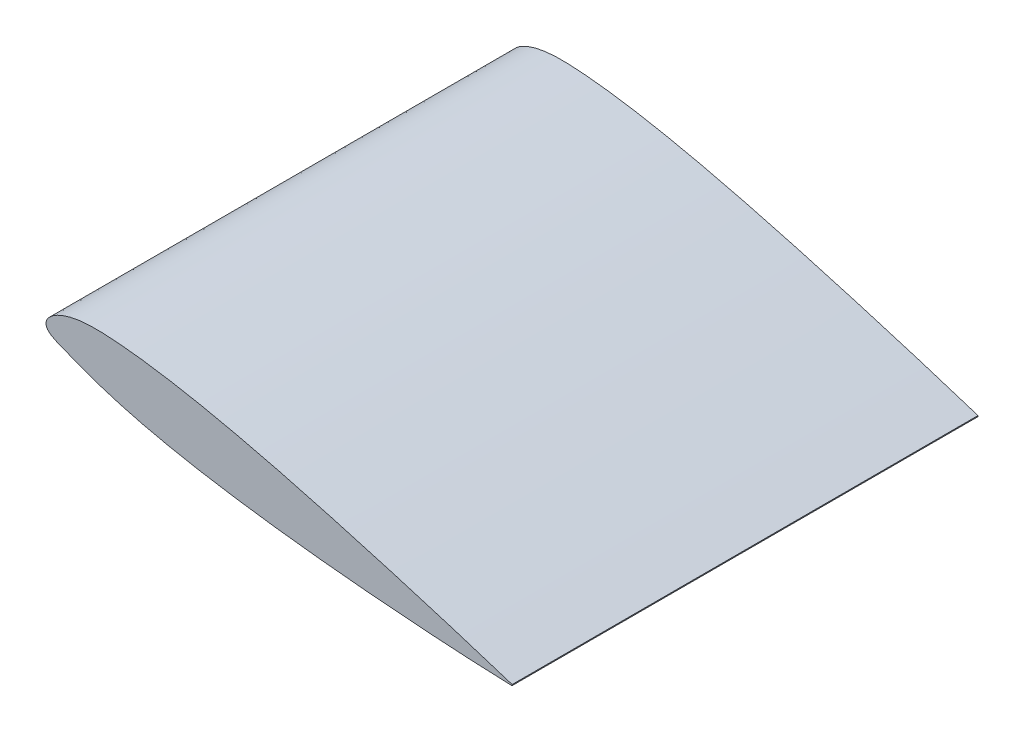
ISO-10303-21;
HEADER;
FILE_DESCRIPTION(('STEP AP214'),'2;1');
FILE_NAME('part.step','',(''),(''),'','','');
FILE_SCHEMA(('AUTOMOTIVE_DESIGN { 1 0 10303 214 1 1 1 1 }'));
ENDSEC;
DATA;
#1=APPLICATION_CONTEXT('core data for automotive mechanical design processes');
#2=APPLICATION_PROTOCOL_DEFINITION('international standard','automotive_design',2000,#1);
#3=PRODUCT_CONTEXT('',#1,'mechanical');
#4=PRODUCT('Part','Part','',(#3));
#5=PRODUCT_RELATED_PRODUCT_CATEGORY('part','',(#4));
#6=PRODUCT_DEFINITION_FORMATION('','',#4);
#7=PRODUCT_DEFINITION_CONTEXT('part definition',#1,'design');
#8=PRODUCT_DEFINITION('design','',#6,#7);
#9=PRODUCT_DEFINITION_SHAPE('','',#8);
#10=(LENGTH_UNIT() NAMED_UNIT(*) SI_UNIT(.MILLI.,.METRE.));
#11=(NAMED_UNIT(*) PLANE_ANGLE_UNIT() SI_UNIT($,.RADIAN.));
#12=(NAMED_UNIT(*) SI_UNIT($,.STERADIAN.) SOLID_ANGLE_UNIT());
#13=UNCERTAINTY_MEASURE_WITH_UNIT(LENGTH_MEASURE(1.E-05),#10,'distance_accuracy_value','');
#14=(GEOMETRIC_REPRESENTATION_CONTEXT(3) GLOBAL_UNCERTAINTY_ASSIGNED_CONTEXT((#13)) GLOBAL_UNIT_ASSIGNED_CONTEXT((#10,
#11,#12)) REPRESENTATION_CONTEXT('',''));
#15=CARTESIAN_POINT('',(0.,0.,0.));
#16=DIRECTION('',(0.,0.,1.));
#17=DIRECTION('',(1.,0.,0.));
#18=AXIS2_PLACEMENT_3D('',#15,#16,#17);
#19=CARTESIAN_POINT('',(500.236459207198,-86.8224635513668,500.));
#20=CARTESIAN_POINT('',(476.503020960118,-79.1176278639472,500.));
#21=CARTESIAN_POINT('',(435.907347364615,-66.3524888259855,500.));
#22=CARTESIAN_POINT('',(379.635127421745,-49.4320829066296,500.));
#23=CARTESIAN_POINT('',(330.514532249199,-35.2102807723863,500.));
#24=CARTESIAN_POINT('',(285.390965798076,-22.7368981144056,500.));
#25=CARTESIAN_POINT('',(243.035728265992,-11.7105314568761,500.));
#26=CARTESIAN_POINT('',(204.980392695257,-2.49819985136352,500.));
#27=CARTESIAN_POINT('',(171.803781869751,4.7449207324609,500.));
#28=CARTESIAN_POINT('',(143.853586044619,10.1265987042974,500.));
#29=CARTESIAN_POINT('',(121.256292772755,13.9343580955584,500.));
#30=CARTESIAN_POINT('',(103.222511952972,16.4662336999911,500.));
#31=CARTESIAN_POINT('',(89.5424860883727,18.0386124332031,500.));
#32=CARTESIAN_POINT('',(79.9178667086725,18.9720570508843,500.));
#33=CARTESIAN_POINT('',(70.6713981269262,19.6784965327707,500.));
#34=CARTESIAN_POINT('',(61.7312174102254,20.1885310051168,500.));
#35=CARTESIAN_POINT('',(53.0506325830021,20.3869931186595,500.));
#36=CARTESIAN_POINT('',(44.69829690075,20.1711048880462,500.));
#37=CARTESIAN_POINT('',(36.8007568884682,19.4845925266658,500.));
#38=CARTESIAN_POINT('',(29.4786046067332,18.3169320409294,500.));
#39=CARTESIAN_POINT('',(22.8392895874302,16.7003482628546,500.));
#40=CARTESIAN_POINT('',(16.9701643031737,14.7008255560025,500.));
#41=CARTESIAN_POINT('',(11.9337199815768,12.4062072950326,500.));
#42=CARTESIAN_POINT('',(7.76602312872007,9.91289421479751,500.));
#43=CARTESIAN_POINT('',(4.47825640239626,7.31270601737493,500.));
#44=CARTESIAN_POINT('',(2.0617798911661,4.68034615206656,500.));
#45=CARTESIAN_POINT('',(0.498418150056765,2.06340703711513,500.));
#46=CARTESIAN_POINT('',(-0.212639902172352,-0.516848309693743,500.));
#47=CARTESIAN_POINT('',(-0.0547873036539287,-2.99209221761267,500.));
#48=CARTESIAN_POINT('',(0.889889682898152,-5.26455614020146,500.));
#49=CARTESIAN_POINT('',(2.52389484198707,-7.28823573679802,500.));
#50=CARTESIAN_POINT('',(4.74064393005906,-9.10510529207239,500.));
#51=CARTESIAN_POINT('',(7.48189417586796,-10.7884207267894,500.));
#52=CARTESIAN_POINT('',(10.7038963781241,-12.4017646475905,500.));
#53=CARTESIAN_POINT('',(14.3705553798277,-14.0030394100811,500.));
#54=CARTESIAN_POINT('',(18.4573610475659,-15.6450874458372,500.));
#55=CARTESIAN_POINT('',(22.9573560306328,-17.3753615213048,500.));
#56=CARTESIAN_POINT('',(27.8856356107827,-19.2351394977452,500.));
#57=CARTESIAN_POINT('',(35.4450752773419,-22.0704584539282,500.));
#58=CARTESIAN_POINT('',(43.7609693607478,-25.174860079427,500.));
#59=CARTESIAN_POINT('',(52.9680444032575,-28.4953607349603,500.));
#60=CARTESIAN_POINT('',(60.956206092516,-31.2333528644054,500.));
#61=CARTESIAN_POINT('',(76.2264699534703,-36.0534102265894,500.));
#62=CARTESIAN_POINT('',(96.1257501910955,-41.4724329413418,500.));
#63=CARTESIAN_POINT('',(124.888774813724,-48.1756250477646,500.));
#64=CARTESIAN_POINT('',(156.417792572736,-54.4498087736004,500.));
#65=CARTESIAN_POINT('',(193.79072903308,-60.7106312544367,500.));
#66=CARTESIAN_POINT('',(232.612641242592,-66.2455068532444,500.));
#67=CARTESIAN_POINT('',(276.130874857722,-71.5852153685459,500.));
#68=CARTESIAN_POINT('',(322.782776335852,-76.4383280816624,500.));
#69=CARTESIAN_POINT('',(373.818568697378,-80.8844885366713,500.));
#70=CARTESIAN_POINT('',(426.854937763661,-84.6597732110225,500.));
#71=CARTESIAN_POINT('',(468.930220781067,-86.8921328631046,500.));
#72=CARTESIAN_POINT('',(493.883055309456,-87.863742522101,500.));
#73=CARTESIAN_POINT('',(499.547240989123,-88.0645897363815,500.));
#74=CARTESIAN_POINT('',(500.014537953767,-88.0810415213396,500.));
#75=B_SPLINE_CURVE_WITH_KNOTS('',3,(#19,#20,#21,#22,#23,#24,#25,#26,#27,#28,#29,#30,#31,#32,#33,
#34,#35,#36,#37,#38,#39,#40,#41,#42,#43,#44,#45,#46,#47,#48,#49,#50,#51,#52,#53,#54,#55,#56,#57,
#58,#59,#60,#61,#62,#63,#64,#65,#66,#67,#68,#69,#70,#71,#72,#73,#74),.UNSPECIFIED.,.F.,.F.,(4,1,
1,1,1,1,1,1,1,1,1,1,1,1,1,1,1,1,1,1,1,1,1,1,1,1,1,1,1,1,1,1,1,1,1,1,1,1,1,1,1,1,1,1,1,1,1,1,1,1,
1,1,1,4),(0.,0.0722550253734794,0.123222088761853,0.170150757534148,0.220331601096186,
0.258781731104678,0.296881738246017,0.333704420461419,0.357104545178893,0.379297669118749,
0.40005543887892,0.409830086831331,0.419169499167558,0.428054093326848,0.436681352682776,
0.445096794601016,0.453189549236812,0.460862874749271,0.468034876100685,0.474639206250323,
0.480625941266989,0.485962658145206,0.490636119254039,0.494655604614058,0.498059761278414,
0.50092918338785,0.503404007348017,0.505690992948918,0.507976561709757,0.510416375078924,
0.513147823691988,0.516239072626078,0.519713615065657,0.523574449703375,0.527821966402288,
0.532466294460743,0.537534821509066,0.543074938596254,0.555844990792284,0.563237838565225,
0.571415938770629,0.580295189374215,0.609601939120403,0.631115834363691,0.665807087469062,
0.702674524037023,0.740833418823869,0.779352204097302,0.829629038329676,0.876644639683574,
0.927690479686737,0.983588069282549,0.998646022995485,1.),.UNSPECIFIED.);
#76=DIRECTION('',(0.,0.,-1.));
#77=VECTOR('',#76,1.);
#78=SURFACE_OF_LINEAR_EXTRUSION('',#75,#77);
#79=CARTESIAN_POINT('',(500.236459207198,-86.8224635513668,0.));
#80=CARTESIAN_POINT('',(476.503020960118,-79.1176278639472,0.));
#81=CARTESIAN_POINT('',(435.907347364615,-66.3524888259855,0.));
#82=CARTESIAN_POINT('',(379.635127421745,-49.4320829066296,0.));
#83=CARTESIAN_POINT('',(330.514532249199,-35.2102807723863,0.));
#84=CARTESIAN_POINT('',(285.390965798076,-22.7368981144056,0.));
#85=CARTESIAN_POINT('',(243.035728265992,-11.7105314568761,0.));
#86=CARTESIAN_POINT('',(204.980392695257,-2.49819985136352,0.));
#87=CARTESIAN_POINT('',(171.803781869751,4.7449207324609,0.));
#88=CARTESIAN_POINT('',(143.853586044619,10.1265987042974,0.));
#89=CARTESIAN_POINT('',(121.256292772755,13.9343580955584,0.));
#90=CARTESIAN_POINT('',(103.222511952972,16.4662336999911,0.));
#91=CARTESIAN_POINT('',(89.5424860883727,18.0386124332031,0.));
#92=CARTESIAN_POINT('',(79.9178667086725,18.9720570508843,0.));
#93=CARTESIAN_POINT('',(70.6713981269262,19.6784965327707,0.));
#94=CARTESIAN_POINT('',(61.7312174102254,20.1885310051168,0.));
#95=CARTESIAN_POINT('',(53.0506325830021,20.3869931186595,0.));
#96=CARTESIAN_POINT('',(44.69829690075,20.1711048880462,0.));
#97=CARTESIAN_POINT('',(36.8007568884682,19.4845925266658,0.));
#98=CARTESIAN_POINT('',(29.4786046067332,18.3169320409294,0.));
#99=CARTESIAN_POINT('',(22.8392895874302,16.7003482628546,0.));
#100=CARTESIAN_POINT('',(16.9701643031737,14.7008255560025,0.));
#101=CARTESIAN_POINT('',(11.9337199815768,12.4062072950326,0.));
#102=CARTESIAN_POINT('',(7.76602312872007,9.91289421479751,0.));
#103=CARTESIAN_POINT('',(4.47825640239626,7.31270601737493,0.));
#104=CARTESIAN_POINT('',(2.0617798911661,4.68034615206656,0.));
#105=CARTESIAN_POINT('',(0.498418150056765,2.06340703711513,0.));
#106=CARTESIAN_POINT('',(-0.212639902172352,-0.516848309693743,0.));
#107=CARTESIAN_POINT('',(-0.0547873036539287,-2.99209221761267,0.));
#108=CARTESIAN_POINT('',(0.889889682898152,-5.26455614020146,0.));
#109=CARTESIAN_POINT('',(2.52389484198707,-7.28823573679802,0.));
#110=CARTESIAN_POINT('',(4.74064393005906,-9.10510529207239,0.));
#111=CARTESIAN_POINT('',(7.48189417586796,-10.7884207267894,0.));
#112=CARTESIAN_POINT('',(10.7038963781241,-12.4017646475905,0.));
#113=CARTESIAN_POINT('',(14.3705553798277,-14.0030394100811,0.));
#114=CARTESIAN_POINT('',(18.4573610475659,-15.6450874458372,0.));
#115=CARTESIAN_POINT('',(22.9573560306328,-17.3753615213048,0.));
#116=CARTESIAN_POINT('',(27.8856356107827,-19.2351394977452,0.));
#117=CARTESIAN_POINT('',(35.4450752773419,-22.0704584539282,0.));
#118=CARTESIAN_POINT('',(43.7609693607478,-25.174860079427,0.));
#119=CARTESIAN_POINT('',(52.9680444032575,-28.4953607349603,0.));
#120=CARTESIAN_POINT('',(60.956206092516,-31.2333528644054,0.));
#121=CARTESIAN_POINT('',(76.2264699534703,-36.0534102265894,0.));
#122=CARTESIAN_POINT('',(96.1257501910955,-41.4724329413418,0.));
#123=CARTESIAN_POINT('',(124.888774813724,-48.1756250477646,0.));
#124=CARTESIAN_POINT('',(156.417792572736,-54.4498087736004,0.));
#125=CARTESIAN_POINT('',(193.79072903308,-60.7106312544367,0.));
#126=CARTESIAN_POINT('',(232.612641242592,-66.2455068532444,0.));
#127=CARTESIAN_POINT('',(276.130874857722,-71.5852153685459,0.));
#128=CARTESIAN_POINT('',(322.782776335852,-76.4383280816624,0.));
#129=CARTESIAN_POINT('',(373.818568697378,-80.8844885366713,0.));
#130=CARTESIAN_POINT('',(426.854937763661,-84.6597732110225,0.));
#131=CARTESIAN_POINT('',(468.930220781067,-86.8921328631046,0.));
#132=CARTESIAN_POINT('',(493.883055309456,-87.863742522101,0.));
#133=CARTESIAN_POINT('',(499.547240989123,-88.0645897363815,0.));
#134=CARTESIAN_POINT('',(500.014537953767,-88.0810415213396,0.));
#135=B_SPLINE_CURVE_WITH_KNOTS('',3,(#79,#80,#81,#82,#83,#84,#85,#86,#87,#88,#89,#90,#91,#92,
#93,#94,#95,#96,#97,#98,#99,#100,#101,#102,#103,#104,#105,#106,#107,#108,#109,#110,#111,#112,
#113,#114,#115,#116,#117,#118,#119,#120,#121,#122,#123,#124,#125,#126,#127,#128,#129,#130,#131,
#132,#133,#134),.UNSPECIFIED.,.F.,.F.,(4,1,1,1,1,1,1,1,1,1,1,1,1,1,1,1,1,1,1,1,1,1,1,1,1,1,1,1,
1,1,1,1,1,1,1,1,1,1,1,1,1,1,1,1,1,1,1,1,1,1,1,1,1,4),(0.,0.0722550253734794,0.123222088761853,
0.170150757534148,0.220331601096186,0.258781731104678,0.296881738246017,0.333704420461419,
0.357104545178893,0.379297669118749,0.40005543887892,0.409830086831331,0.419169499167558,
0.428054093326848,0.436681352682776,0.445096794601016,0.453189549236812,0.460862874749271,
0.468034876100685,0.474639206250323,0.480625941266989,0.485962658145206,0.490636119254039,
0.494655604614058,0.498059761278414,0.50092918338785,0.503404007348017,0.505690992948918,
0.507976561709757,0.510416375078924,0.513147823691988,0.516239072626078,0.519713615065657,
0.523574449703375,0.527821966402288,0.532466294460743,0.537534821509066,0.543074938596254,
0.555844990792284,0.563237838565225,0.571415938770629,0.580295189374215,0.609601939120403,
0.631115834363691,0.665807087469062,0.702674524037023,0.740833418823869,0.779352204097302,
0.829629038329676,0.876644639683574,0.927690479686737,0.983588069282549,0.998646022995485,1.),.UNSPECIFIED.);
#136=CARTESIAN_POINT('',(500.236459207198,-86.8224635513668,0.));
#137=VERTEX_POINT('',#136);
#138=CARTESIAN_POINT('',(500.014537953767,-88.0810415213396,0.));
#139=VERTEX_POINT('',#138);
#140=EDGE_CURVE('E81',#137,#139,#135,.T.);
#141=ORIENTED_EDGE('',*,*,#140,.T.);
#142=DIRECTION('',(0.,0.,-1.));
#143=VECTOR('',#142,1.);
#144=CARTESIAN_POINT('',(500.014537953767,-88.0810415213396,500.));
#145=LINE('',#144,#143);
#146=CARTESIAN_POINT('',(500.014537953767,-88.0810415213396,500.));
#147=VERTEX_POINT('',#146);
#148=EDGE_CURVE('E11',#147,#139,#145,.T.);
#149=ORIENTED_EDGE('',*,*,#148,.F.);
#150=CARTESIAN_POINT('',(500.236459207198,-86.8224635513668,500.));
#151=VERTEX_POINT('',#150);
#152=EDGE_CURVE('E80',#151,#147,#75,.T.);
#153=ORIENTED_EDGE('',*,*,#152,.F.);
#154=DIRECTION('',(0.,0.,-1.));
#155=VECTOR('',#154,1.);
#156=CARTESIAN_POINT('',(500.236459207198,-86.8224635513668,500.));
#157=LINE('',#156,#155);
#158=EDGE_CURVE('E57',#151,#137,#157,.T.);
#159=ORIENTED_EDGE('',*,*,#158,.T.);
#160=EDGE_LOOP('',(#141,#149,#153,#159));
#161=FACE_BOUND('',#160,.T.);
#162=ADVANCED_FACE('F47',(#161),#78,.F.);
#163=CARTESIAN_POINT('',(500.236459207198,-86.8224635513668,500.));
#164=DIRECTION('',(-0.984807753012213,0.173648177666903,0.));
#165=DIRECTION('',(-0.173648177666903,-0.984807753012213,0.));
#166=AXIS2_PLACEMENT_3D('',#163,#164,#165);
#167=PLANE('',#166);
#168=DIRECTION('',(0.173648177666903,0.984807753012213,0.));
#169=VECTOR('',#168,1.);
#170=CARTESIAN_POINT('',(500.236459207198,-86.8224635513668,0.));
#171=LINE('',#170,#169);
#172=EDGE_CURVE('E72',#139,#137,#171,.T.);
#173=ORIENTED_EDGE('',*,*,#172,.T.);
#174=ORIENTED_EDGE('',*,*,#158,.F.);
#175=DIRECTION('',(0.173648177666903,0.984807753012213,0.));
#176=VECTOR('',#175,1.);
#177=CARTESIAN_POINT('',(500.236459207198,-86.8224635513668,500.));
#178=LINE('',#177,#176);
#179=EDGE_CURVE('E64',#147,#151,#178,.T.);
#180=ORIENTED_EDGE('',*,*,#179,.F.);
#181=ORIENTED_EDGE('',*,*,#148,.T.);
#182=EDGE_LOOP('',(#173,#174,#180,#181));
#183=FACE_BOUND('',#182,.T.);
#184=ADVANCED_FACE('F75',(#183),#167,.F.);
#185=CARTESIAN_POINT('',(0.969279293752556,2.75871657304227,500.));
#186=DIRECTION('',(0.,0.,-1.));
#187=DIRECTION('',(-1.,0.,0.));
#188=AXIS2_PLACEMENT_3D('',#185,#186,#187);
#189=PLANE('',#188);
#190=ORIENTED_EDGE('',*,*,#152,.T.);
#191=ORIENTED_EDGE('',*,*,#179,.T.);
#192=EDGE_LOOP('',(#190,#191));
#193=FACE_BOUND('',#192,.T.);
#194=ADVANCED_FACE('F103',(#193),#189,.F.);
#195=CARTESIAN_POINT('',(0.969279293752556,2.75871657304227,0.));
#196=DIRECTION('',(0.,0.,-1.));
#197=DIRECTION('',(-1.,0.,0.));
#198=AXIS2_PLACEMENT_3D('',#195,#196,#197);
#199=PLANE('',#198);
#200=ORIENTED_EDGE('',*,*,#140,.F.);
#201=ORIENTED_EDGE('',*,*,#172,.F.);
#202=EDGE_LOOP('',(#200,#201));
#203=FACE_BOUND('',#202,.T.);
#204=ADVANCED_FACE('F85',(#203),#199,.T.);
#205=CLOSED_SHELL('',(#162,#184,#194,#204));
#206=MANIFOLD_SOLID_BREP('B2',#205);
#207=ADVANCED_BREP_SHAPE_REPRESENTATION('',(#18,#206),#14);
#208=SHAPE_DEFINITION_REPRESENTATION(#9,#207);
ENDSEC;
END-ISO-10303-21;
